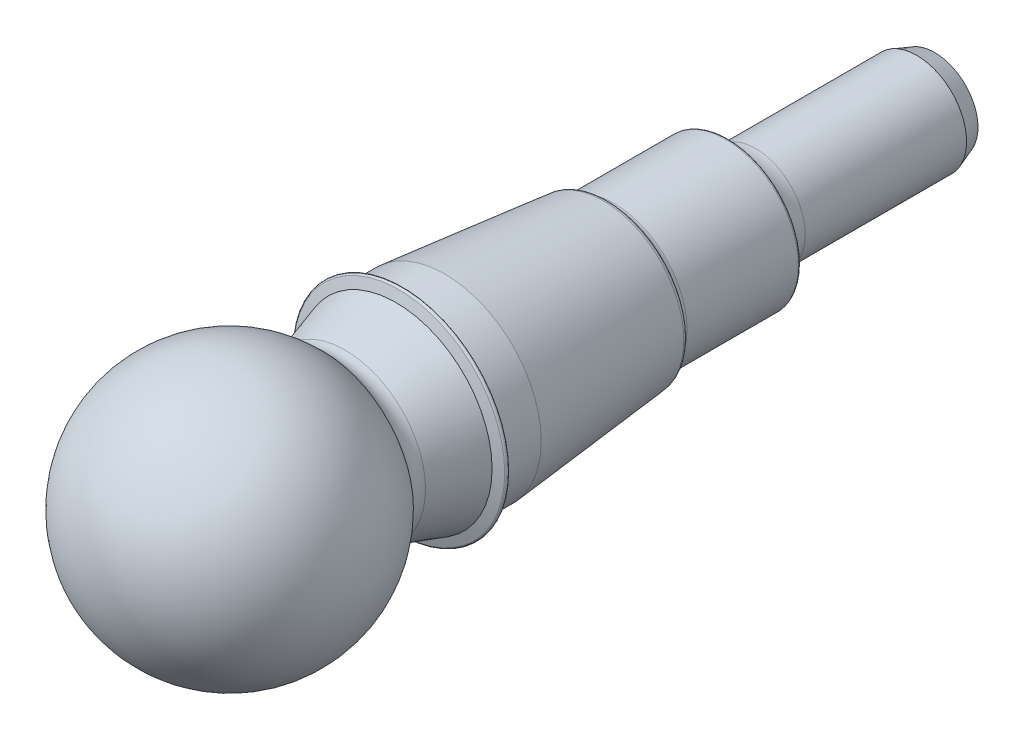
ISO-10303-21;
HEADER;
FILE_DESCRIPTION(('STEP AP214'),'2;1');
FILE_NAME('part.step','',(''),(''),'','','');
FILE_SCHEMA(('AUTOMOTIVE_DESIGN { 1 0 10303 214 1 1 1 1 }'));
ENDSEC;
DATA;
#1=APPLICATION_CONTEXT('core data for automotive mechanical design processes');
#2=APPLICATION_PROTOCOL_DEFINITION('international standard','automotive_design',2000,#1);
#3=PRODUCT_CONTEXT('',#1,'mechanical');
#4=PRODUCT('Part','Part','',(#3));
#5=PRODUCT_RELATED_PRODUCT_CATEGORY('part','',(#4));
#6=PRODUCT_DEFINITION_FORMATION('','',#4);
#7=PRODUCT_DEFINITION_CONTEXT('part definition',#1,'design');
#8=PRODUCT_DEFINITION('design','',#6,#7);
#9=PRODUCT_DEFINITION_SHAPE('','',#8);
#10=(LENGTH_UNIT() NAMED_UNIT(*) SI_UNIT(.MILLI.,.METRE.));
#11=(NAMED_UNIT(*) PLANE_ANGLE_UNIT() SI_UNIT($,.RADIAN.));
#12=(NAMED_UNIT(*) SI_UNIT($,.STERADIAN.) SOLID_ANGLE_UNIT());
#13=UNCERTAINTY_MEASURE_WITH_UNIT(LENGTH_MEASURE(1.E-05),#10,'distance_accuracy_value','');
#14=(GEOMETRIC_REPRESENTATION_CONTEXT(3) GLOBAL_UNCERTAINTY_ASSIGNED_CONTEXT((#13)) GLOBAL_UNIT_ASSIGNED_CONTEXT((#10,
#11,#12)) REPRESENTATION_CONTEXT('',''));
#15=CARTESIAN_POINT('',(0.,0.,0.));
#16=DIRECTION('',(0.,0.,1.));
#17=DIRECTION('',(1.,0.,0.));
#18=AXIS2_PLACEMENT_3D('',#15,#16,#17);
#19=CARTESIAN_POINT('',(0.,0.,20.28358340657));
#20=DIRECTION('',(0.,0.,1.));
#21=DIRECTION('',(1.,0.,0.));
#22=AXIS2_PLACEMENT_3D('',#19,#20,#21);
#23=CYLINDRICAL_SURFACE('',#22,5.47);
#24=CARTESIAN_POINT('',(0.,0.,-57.800000000001));
#25=DIRECTION('',(0.,0.,1.));
#26=DIRECTION('',(1.,0.,0.));
#27=AXIS2_PLACEMENT_3D('',#24,#25,#26);
#28=CIRCLE('',#27,5.47);
#29=CARTESIAN_POINT('',(5.47,0.,-57.800000000001));
#30=VERTEX_POINT('',#29);
#31=EDGE_CURVE('E12',#30,#30,#28,.T.);
#32=ORIENTED_EDGE('',*,*,#31,.F.);
#33=EDGE_LOOP('',(#32));
#34=FACE_BOUND('',#33,.T.);
#35=CARTESIAN_POINT('',(0.,0.,-75.5218162579571));
#36=DIRECTION('',(0.,0.,1.));
#37=DIRECTION('',(1.,0.,0.));
#38=AXIS2_PLACEMENT_3D('',#35,#36,#37);
#39=CIRCLE('',#38,5.47);
#40=CARTESIAN_POINT('',(5.47,0.,-75.5218162579571));
#41=VERTEX_POINT('',#40);
#42=EDGE_CURVE('E111',#41,#41,#39,.T.);
#43=ORIENTED_EDGE('',*,*,#42,.T.);
#44=EDGE_LOOP('',(#43));
#45=FACE_BOUND('',#44,.T.);
#46=ADVANCED_FACE('F47',(#34,#45),#23,.T.);
#47=CARTESIAN_POINT('',(0.,0.,-57.800000000001));
#48=DIRECTION('',(0.,0.,1.));
#49=DIRECTION('',(1.,0.,0.));
#50=AXIS2_PLACEMENT_3D('',#47,#48,#49);
#51=TOROIDAL_SURFACE('',#50,9.774813997947,4.304813997947);
#52=CARTESIAN_POINT('',(0.,0.,-56.1906927421493));
#53=DIRECTION('',(0.,0.,1.));
#54=DIRECTION('',(1.,0.,0.));
#55=AXIS2_PLACEMENT_3D('',#52,#53,#54);
#56=CIRCLE('',#55,5.78212646863215);
#57=CARTESIAN_POINT('',(5.78212646863215,0.,-56.1906927421493));
#58=VERTEX_POINT('',#57);
#59=EDGE_CURVE('E53',#58,#58,#56,.T.);
#60=ORIENTED_EDGE('',*,*,#59,.F.);
#61=EDGE_LOOP('',(#60));
#62=FACE_BOUND('',#61,.T.);
#63=ORIENTED_EDGE('',*,*,#31,.T.);
#64=EDGE_LOOP('',(#63));
#65=FACE_BOUND('',#64,.T.);
#66=ADVANCED_FACE('F133',(#62,#65),#51,.F.);
#67=CARTESIAN_POINT('',(0.,0.,-57.2119335245047));
#68=DIRECTION('',(0.,0.,1.));
#69=DIRECTION('',(1.,0.,0.));
#70=AXIS2_PLACEMENT_3D('',#67,#68,#69);
#71=TOROIDAL_SURFACE('',#70,8.31582245256844,2.73176647511474);
#72=CARTESIAN_POINT('',(0.,0.,-55.2934508361499));
#73=DIRECTION('',(0.,0.,1.));
#74=DIRECTION('',(1.,0.,0.));
#75=AXIS2_PLACEMENT_3D('',#72,#73,#74);
#76=CIRCLE('',#75,6.37109310146489);
#77=CARTESIAN_POINT('',(6.37109310146489,0.,-55.2934508361499));
#78=VERTEX_POINT('',#77);
#79=EDGE_CURVE('E57',#78,#78,#76,.T.);
#80=ORIENTED_EDGE('',*,*,#79,.F.);
#81=EDGE_LOOP('',(#80));
#82=FACE_BOUND('',#81,.T.);
#83=ORIENTED_EDGE('',*,*,#59,.T.);
#84=EDGE_LOOP('',(#83));
#85=FACE_BOUND('',#84,.T.);
#86=ADVANCED_FACE('F138',(#82,#85),#71,.F.);
#87=CARTESIAN_POINT('',(0.,0.,-56.5367215490749));
#88=DIRECTION('',(0.,0.,1.));
#89=DIRECTION('',(1.,0.,0.));
#90=AXIS2_PLACEMENT_3D('',#87,#88,#89);
#91=TOROIDAL_SURFACE('',#90,7.63137293691445,1.77031842594992);
#92=CARTESIAN_POINT('',(0.,0.,-54.9134954315118));
#93=DIRECTION('',(0.,0.,1.));
#94=DIRECTION('',(1.,0.,0.));
#95=AXIS2_PLACEMENT_3D('',#92,#93,#94);
#96=CIRCLE('',#95,6.92485733162416);
#97=CARTESIAN_POINT('',(6.92485733162416,0.,-54.9134954315118));
#98=VERTEX_POINT('',#97);
#99=EDGE_CURVE('E61',#98,#98,#96,.T.);
#100=ORIENTED_EDGE('',*,*,#99,.F.);
#101=EDGE_LOOP('',(#100));
#102=FACE_BOUND('',#101,.T.);
#103=ORIENTED_EDGE('',*,*,#79,.T.);
#104=EDGE_LOOP('',(#103));
#105=FACE_BOUND('',#104,.T.);
#106=ADVANCED_FACE('F143',(#102,#105),#91,.F.);
#107=CARTESIAN_POINT('',(0.,0.,-56.165965738579));
#108=DIRECTION('',(0.,0.,1.));
#109=DIRECTION('',(1.,0.,0.));
#110=AXIS2_PLACEMENT_3D('',#107,#108,#109);
#111=TOROIDAL_SURFACE('',#110,7.47,1.36596573857804);
#112=CARTESIAN_POINT('',(0.,0.,-54.800000000001));
#113=DIRECTION('',(0.,0.,1.));
#114=DIRECTION('',(1.,0.,0.));
#115=AXIS2_PLACEMENT_3D('',#112,#113,#114);
#116=CIRCLE('',#115,7.47);
#117=CARTESIAN_POINT('',(7.47,0.,-54.800000000001));
#118=VERTEX_POINT('',#117);
#119=EDGE_CURVE('E66',#118,#118,#116,.T.);
#120=ORIENTED_EDGE('',*,*,#119,.F.);
#121=EDGE_LOOP('',(#120));
#122=FACE_BOUND('',#121,.T.);
#123=ORIENTED_EDGE('',*,*,#99,.T.);
#124=EDGE_LOOP('',(#123));
#125=FACE_BOUND('',#124,.T.);
#126=ADVANCED_FACE('F149',(#122,#125),#111,.F.);
#127=CARTESIAN_POINT('',(0.,7.69999999999877,-54.8000000000011));
#128=DIRECTION('',(0.,0.,1.));
#129=DIRECTION('',(1.,0.,0.));
#130=AXIS2_PLACEMENT_3D('',#127,#128,#129);
#131=PLANE('',#130);
#132=CARTESIAN_POINT('',(0.,0.,-54.8000000000012));
#133=DIRECTION('',(0.,0.,1.));
#134=DIRECTION('',(1.,0.,0.));
#135=AXIS2_PLACEMENT_3D('',#132,#133,#134);
#136=CIRCLE('',#135,7.69999999999877);
#137=CARTESIAN_POINT('',(7.69999999999877,0.,-54.8000000000012));
#138=VERTEX_POINT('',#137);
#139=EDGE_CURVE('E69',#138,#138,#136,.T.);
#140=ORIENTED_EDGE('',*,*,#139,.F.);
#141=EDGE_LOOP('',(#140));
#142=FACE_BOUND('',#141,.T.);
#143=ORIENTED_EDGE('',*,*,#119,.T.);
#144=EDGE_LOOP('',(#143));
#145=FACE_BOUND('',#144,.T.);
#146=ADVANCED_FACE('F153',(#142,#145),#131,.F.);
#147=CARTESIAN_POINT('',(0.,0.,-54.5000000000013));
#148=DIRECTION('',(0.,0.,1.));
#149=DIRECTION('',(1.,0.,0.));
#150=AXIS2_PLACEMENT_3D('',#147,#148,#149);
#151=TOROIDAL_SURFACE('',#150,7.69999999999877,0.300000000000005);
#152=CARTESIAN_POINT('',(0.,0.,-54.5000000000013));
#153=DIRECTION('',(0.,0.,1.));
#154=DIRECTION('',(1.,0.,0.));
#155=AXIS2_PLACEMENT_3D('',#152,#153,#154);
#156=CIRCLE('',#155,7.99999999999877);
#157=CARTESIAN_POINT('',(7.99999999999877,0.,-54.5000000000013));
#158=VERTEX_POINT('',#157);
#159=EDGE_CURVE('E72',#158,#158,#156,.T.);
#160=ORIENTED_EDGE('',*,*,#159,.F.);
#161=EDGE_LOOP('',(#160));
#162=FACE_BOUND('',#161,.T.);
#163=ORIENTED_EDGE('',*,*,#139,.T.);
#164=EDGE_LOOP('',(#163));
#165=FACE_BOUND('',#164,.T.);
#166=ADVANCED_FACE('F157',(#162,#165),#151,.T.);
#167=CARTESIAN_POINT('',(0.,0.,20.28358340657));
#168=DIRECTION('',(0.,0.,1.));
#169=DIRECTION('',(1.,0.,0.));
#170=AXIS2_PLACEMENT_3D('',#167,#168,#169);
#171=CYLINDRICAL_SURFACE('',#170,7.99999999999877);
#172=CARTESIAN_POINT('',(0.,0.,-42.2771329387013));
#173=DIRECTION('',(0.,0.,1.));
#174=DIRECTION('',(1.,0.,0.));
#175=AXIS2_PLACEMENT_3D('',#172,#173,#174);
#176=CIRCLE('',#175,7.99999999999876);
#177=CARTESIAN_POINT('',(7.99999999999876,0.,-42.2771329387013));
#178=VERTEX_POINT('',#177);
#179=EDGE_CURVE('E75',#178,#178,#176,.T.);
#180=ORIENTED_EDGE('',*,*,#179,.F.);
#181=EDGE_LOOP('',(#180));
#182=FACE_BOUND('',#181,.T.);
#183=ORIENTED_EDGE('',*,*,#159,.T.);
#184=EDGE_LOOP('',(#183));
#185=FACE_BOUND('',#184,.T.);
#186=ADVANCED_FACE('F161',(#182,#185),#171,.T.);
#187=CARTESIAN_POINT('',(0.,0.,-42.2771329387012));
#188=DIRECTION('',(0.,0.,1.));
#189=DIRECTION('',(1.,0.,0.));
#190=AXIS2_PLACEMENT_3D('',#187,#188,#189);
#191=TOROIDAL_SURFACE('',#190,8.74999999999872,0.749999999999954);
#192=CARTESIAN_POINT('',(0.,0.,-41.6276138858629));
#193=DIRECTION('',(0.,0.,1.));
#194=DIRECTION('',(1.,0.,0.));
#195=AXIS2_PLACEMENT_3D('',#192,#193,#194);
#196=CIRCLE('',#195,8.3749999999988);
#197=CARTESIAN_POINT('',(8.3749999999988,0.,-41.6276138858629));
#198=VERTEX_POINT('',#197);
#199=EDGE_CURVE('E78',#198,#198,#196,.T.);
#200=ORIENTED_EDGE('',*,*,#199,.F.);
#201=EDGE_LOOP('',(#200));
#202=FACE_BOUND('',#201,.T.);
#203=ORIENTED_EDGE('',*,*,#179,.T.);
#204=EDGE_LOOP('',(#203));
#205=FACE_BOUND('',#204,.T.);
#206=ADVANCED_FACE('F165',(#202,#205),#191,.F.);
#207=CARTESIAN_POINT('',(0.,0.,-41.6276138858629));
#208=DIRECTION('',(0.,0.,1.));
#209=DIRECTION('',(1.,0.,0.));
#210=AXIS2_PLACEMENT_3D('',#207,#208,#209);
#211=CONICAL_SURFACE('',#210,8.3749999999988,1.04719755119664);
#212=CARTESIAN_POINT('',(0.,0.,-41.5196152422668));
#213=DIRECTION('',(0.,0.,1.));
#214=DIRECTION('',(1.,0.,0.));
#215=AXIS2_PLACEMENT_3D('',#212,#213,#214);
#216=CIRCLE('',#215,8.5620591378558);
#217=CARTESIAN_POINT('',(8.5620591378558,0.,-41.5196152422668));
#218=VERTEX_POINT('',#217);
#219=EDGE_CURVE('E81',#218,#218,#216,.T.);
#220=ORIENTED_EDGE('',*,*,#219,.F.);
#221=EDGE_LOOP('',(#220));
#222=FACE_BOUND('',#221,.T.);
#223=ORIENTED_EDGE('',*,*,#199,.T.);
#224=EDGE_LOOP('',(#223));
#225=FACE_BOUND('',#224,.T.);
#226=ADVANCED_FACE('F169',(#222,#225),#211,.T.);
#227=CARTESIAN_POINT('',(0.,0.,-40.9999999999961));
#228=DIRECTION('',(0.,0.,1.));
#229=DIRECTION('',(1.,0.,0.));
#230=AXIS2_PLACEMENT_3D('',#227,#228,#229);
#231=TOROIDAL_SURFACE('',#230,8.26205913785583,0.600000000000001);
#232=CARTESIAN_POINT('',(0.,0.,-41.0597023029176));
#233=DIRECTION('',(0.,0.,1.));
#234=DIRECTION('',(1.,0.,0.));
#235=AXIS2_PLACEMENT_3D('',#232,#233,#234);
#236=CIRCLE('',#235,8.85908144483093);
#237=CARTESIAN_POINT('',(8.85908144483093,0.,-41.0597023029176));
#238=VERTEX_POINT('',#237);
#239=EDGE_CURVE('E84',#238,#238,#236,.T.);
#240=ORIENTED_EDGE('',*,*,#239,.F.);
#241=EDGE_LOOP('',(#240));
#242=FACE_BOUND('',#241,.T.);
#243=ORIENTED_EDGE('',*,*,#219,.T.);
#244=EDGE_LOOP('',(#243));
#245=FACE_BOUND('',#244,.T.);
#246=ADVANCED_FACE('F173',(#242,#245),#231,.T.);
#247=CARTESIAN_POINT('',(0.,0.,-41.0597023029176));
#248=DIRECTION('',(0.,0.,1.));
#249=DIRECTION('',(1.,0.,0.));
#250=AXIS2_PLACEMENT_3D('',#247,#248,#249);
#251=CONICAL_SURFACE('',#250,8.85908144483093,0.0996687722670128);
#252=CARTESIAN_POINT('',(0.,0.,-23.6505378117217));
#253=DIRECTION('',(0.,0.,1.));
#254=DIRECTION('',(1.,0.,0.));
#255=AXIS2_PLACEMENT_3D('',#252,#253,#254);
#256=CIRCLE('',#255,10.6);
#257=CARTESIAN_POINT('',(10.6,0.,-23.6505378117217));
#258=VERTEX_POINT('',#257);
#259=EDGE_CURVE('E87',#258,#258,#256,.T.);
#260=ORIENTED_EDGE('',*,*,#259,.F.);
#261=EDGE_LOOP('',(#260));
#262=FACE_BOUND('',#261,.T.);
#263=ORIENTED_EDGE('',*,*,#239,.T.);
#264=EDGE_LOOP('',(#263));
#265=FACE_BOUND('',#264,.T.);
#266=ADVANCED_FACE('F177',(#262,#265),#251,.T.);
#267=CARTESIAN_POINT('',(0.,0.,20.28358340657));
#268=DIRECTION('',(0.,0.,1.));
#269=DIRECTION('',(1.,0.,0.));
#270=AXIS2_PLACEMENT_3D('',#267,#268,#269);
#271=CYLINDRICAL_SURFACE('',#270,10.6);
#272=CARTESIAN_POINT('',(0.,0.,-19.3));
#273=DIRECTION('',(0.,0.,1.));
#274=DIRECTION('',(1.,0.,0.));
#275=AXIS2_PLACEMENT_3D('',#272,#273,#274);
#276=CIRCLE('',#275,10.6);
#277=CARTESIAN_POINT('',(10.6,0.,-19.3));
#278=VERTEX_POINT('',#277);
#279=EDGE_CURVE('E90',#278,#278,#276,.T.);
#280=ORIENTED_EDGE('',*,*,#279,.F.);
#281=EDGE_LOOP('',(#280));
#282=FACE_BOUND('',#281,.T.);
#283=ORIENTED_EDGE('',*,*,#259,.T.);
#284=EDGE_LOOP('',(#283));
#285=FACE_BOUND('',#284,.T.);
#286=ADVANCED_FACE('F181',(#282,#285),#271,.T.);
#287=CARTESIAN_POINT('',(0.,0.,-19.3));
#288=DIRECTION('',(0.,0.,1.));
#289=DIRECTION('',(1.,0.,0.));
#290=AXIS2_PLACEMENT_3D('',#287,#288,#289);
#291=CONICAL_SURFACE('',#290,10.6,1.30899693899574);
#292=CARTESIAN_POINT('',(0.,0.,-19.0333808142341));
#293=DIRECTION('',(0.,0.,1.));
#294=DIRECTION('',(1.,0.,0.));
#295=AXIS2_PLACEMENT_3D('',#292,#293,#294);
#296=CIRCLE('',#295,11.595036347551);
#297=CARTESIAN_POINT('',(11.595036347551,0.,-19.0333808142341));
#298=VERTEX_POINT('',#297);
#299=EDGE_CURVE('E93',#298,#298,#296,.T.);
#300=ORIENTED_EDGE('',*,*,#299,.F.);
#301=EDGE_LOOP('',(#300));
#302=FACE_BOUND('',#301,.T.);
#303=ORIENTED_EDGE('',*,*,#279,.T.);
#304=EDGE_LOOP('',(#303));
#305=FACE_BOUND('',#304,.T.);
#306=ADVANCED_FACE('F185',(#302,#305),#291,.T.);
#307=CARTESIAN_POINT('',(0.,0.,-18.8314282504944));
#308=DIRECTION('',(0.,0.,1.));
#309=DIRECTION('',(1.,0.,0.));
#310=AXIS2_PLACEMENT_3D('',#307,#308,#309);
#311=TOROIDAL_SURFACE('',#310,11.5409233211875,0.209076678812498);
#312=CARTESIAN_POINT('',(0.,0.,-18.6320282779047));
#313=DIRECTION('',(0.,0.,1.));
#314=DIRECTION('',(1.,0.,0.));
#315=AXIS2_PLACEMENT_3D('',#312,#313,#314);
#316=CIRCLE('',#315,11.6037938910475);
#317=CARTESIAN_POINT('',(11.6037938910475,0.,-18.6320282779047));
#318=VERTEX_POINT('',#317);
#319=EDGE_CURVE('E96',#318,#318,#316,.T.);
#320=ORIENTED_EDGE('',*,*,#319,.F.);
#321=EDGE_LOOP('',(#320));
#322=FACE_BOUND('',#321,.T.);
#323=ORIENTED_EDGE('',*,*,#299,.T.);
#324=EDGE_LOOP('',(#323));
#325=FACE_BOUND('',#324,.T.);
#326=ADVANCED_FACE('F189',(#322,#325),#311,.T.);
#327=CARTESIAN_POINT('',(0.,0.,-18.6320282779047));
#328=DIRECTION('',(0.,0.,-1.));
#329=DIRECTION('',(-1.,0.,0.));
#330=AXIS2_PLACEMENT_3D('',#327,#328,#329);
#331=CONICAL_SURFACE('',#330,11.6037938910475,1.26536370769589);
#332=CARTESIAN_POINT('',(0.,0.,-18.3));
#333=DIRECTION('',(0.,0.,1.));
#334=DIRECTION('',(1.,0.,0.));
#335=AXIS2_PLACEMENT_3D('',#332,#333,#334);
#336=CIRCLE('',#335,10.5507347306072);
#337=CARTESIAN_POINT('',(10.5507347306072,0.,-18.3));
#338=VERTEX_POINT('',#337);
#339=EDGE_CURVE('E99',#338,#338,#336,.T.);
#340=ORIENTED_EDGE('',*,*,#339,.F.);
#341=EDGE_LOOP('',(#340));
#342=FACE_BOUND('',#341,.T.);
#343=ORIENTED_EDGE('',*,*,#319,.T.);
#344=EDGE_LOOP('',(#343));
#345=FACE_BOUND('',#344,.T.);
#346=ADVANCED_FACE('F193',(#342,#345),#331,.T.);
#347=CARTESIAN_POINT('',(0.,0.,-18.3));
#348=DIRECTION('',(0.,0.,-1.));
#349=DIRECTION('',(-1.,0.,0.));
#350=AXIS2_PLACEMENT_3D('',#347,#348,#349);
#351=CONICAL_SURFACE('',#350,10.5507347306072,0.29670597283903);
#352=CARTESIAN_POINT('',(0.,0.,-12.6959034979452));
#353=DIRECTION('',(0.,0.,1.));
#354=DIRECTION('',(1.,0.,0.));
#355=AXIS2_PLACEMENT_3D('',#352,#353,#354);
#356=CIRCLE('',#355,8.83739048807393);
#357=CARTESIAN_POINT('',(8.83739048807393,0.,-12.6959034979452));
#358=VERTEX_POINT('',#357);
#359=EDGE_CURVE('E102',#358,#358,#356,.T.);
#360=ORIENTED_EDGE('',*,*,#359,.F.);
#361=EDGE_LOOP('',(#360));
#362=FACE_BOUND('',#361,.T.);
#363=ORIENTED_EDGE('',*,*,#339,.T.);
#364=EDGE_LOOP('',(#363));
#365=FACE_BOUND('',#364,.T.);
#366=ADVANCED_FACE('F197',(#362,#365),#351,.T.);
#367=CARTESIAN_POINT('',(0.,0.,-12.1111600884997));
#368=DIRECTION('',(0.,0.,1.));
#369=DIRECTION('',(1.,0.,0.));
#370=AXIS2_PLACEMENT_3D('',#367,#368,#369);
#371=TOROIDAL_SURFACE('',#370,10.75,2.);
#372=CARTESIAN_POINT('',(0.,0.,-10.3));
#373=DIRECTION('',(0.,0.,1.));
#374=DIRECTION('',(1.,0.,0.));
#375=AXIS2_PLACEMENT_3D('',#372,#373,#374);
#376=CIRCLE('',#375,9.90164916819416);
#377=CARTESIAN_POINT('',(9.90164916819416,0.,-10.3));
#378=VERTEX_POINT('',#377);
#379=EDGE_CURVE('E105',#378,#378,#376,.T.);
#380=ORIENTED_EDGE('',*,*,#379,.F.);
#381=EDGE_LOOP('',(#380));
#382=FACE_BOUND('',#381,.T.);
#383=ORIENTED_EDGE('',*,*,#359,.T.);
#384=EDGE_LOOP('',(#383));
#385=FACE_BOUND('',#384,.T.);
#386=ADVANCED_FACE('F129',(#382,#385),#371,.F.);
#387=CARTESIAN_POINT('',(0.,0.,0.));
#388=DIRECTION('',(0.,0.,1.));
#389=DIRECTION('',(0.,1.,0.));
#390=AXIS2_PLACEMENT_3D('',#387,#388,#389);
#391=SPHERICAL_SURFACE('',#390,14.2875);
#392=ORIENTED_EDGE('',*,*,#379,.T.);
#393=EDGE_LOOP('',(#392));
#394=FACE_BOUND('',#393,.T.);
#395=ADVANCED_FACE('F124',(#394),#391,.T.);
#396=CARTESIAN_POINT('',(0.,0.,-77.4999999999645));
#397=DIRECTION('',(0.,0.,1.));
#398=DIRECTION('',(1.,0.,0.));
#399=AXIS2_PLACEMENT_3D('',#396,#397,#398);
#400=PLANE('',#399);
#401=CARTESIAN_POINT('',(0.,0.,-77.4999999999645));
#402=DIRECTION('',(0.,0.,1.));
#403=DIRECTION('',(1.,0.,0.));
#404=AXIS2_PLACEMENT_3D('',#401,#402,#403);
#405=CIRCLE('',#404,4.75);
#406=CARTESIAN_POINT('',(4.75,0.,-77.4999999999645));
#407=VERTEX_POINT('',#406);
#408=EDGE_CURVE('E108',#407,#407,#405,.T.);
#409=ORIENTED_EDGE('',*,*,#408,.F.);
#410=EDGE_LOOP('',(#409));
#411=FACE_BOUND('',#410,.T.);
#412=ADVANCED_FACE('F119',(#411),#400,.F.);
#413=CARTESIAN_POINT('',(0.,0.,-77.4999999999645));
#414=DIRECTION('',(0.,0.,1.));
#415=DIRECTION('',(1.,0.,0.));
#416=AXIS2_PLACEMENT_3D('',#413,#414,#415);
#417=CONICAL_SURFACE('',#416,4.75,0.349065850398864);
#418=ORIENTED_EDGE('',*,*,#42,.F.);
#419=EDGE_LOOP('',(#418));
#420=FACE_BOUND('',#419,.T.);
#421=ORIENTED_EDGE('',*,*,#408,.T.);
#422=EDGE_LOOP('',(#421));
#423=FACE_BOUND('',#422,.T.);
#424=ADVANCED_FACE('F116',(#420,#423),#417,.T.);
#425=CLOSED_SHELL('',(#46,#66,#86,#106,#126,#146,#166,#186,#206,#226,#246,#266,#286,#306,#326,
#346,#366,#386,#395,#412,#424));
#426=MANIFOLD_SOLID_BREP('B2',#425);
#427=ADVANCED_BREP_SHAPE_REPRESENTATION('',(#18,#426),#14);
#428=SHAPE_DEFINITION_REPRESENTATION(#9,#427);
ENDSEC;
END-ISO-10303-21;
